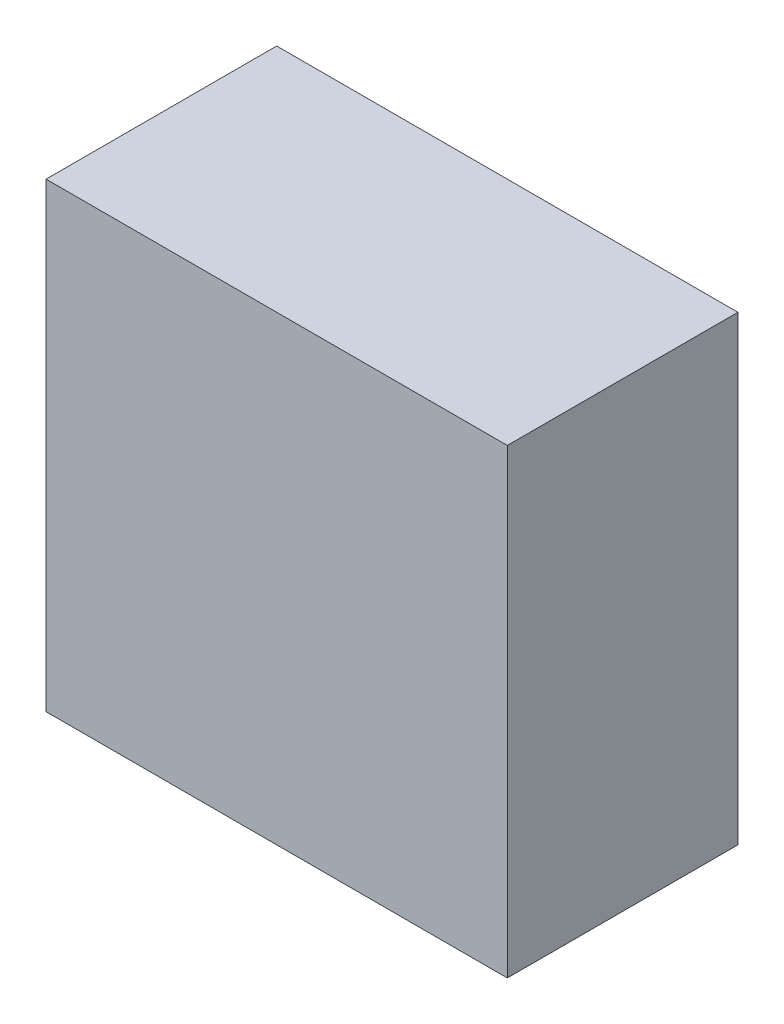
ISO-10303-21;
HEADER;
FILE_DESCRIPTION(('STEP AP214'),'2;1');
FILE_NAME('part.step','',(''),(''),'','','');
FILE_SCHEMA(('AUTOMOTIVE_DESIGN { 1 0 10303 214 1 1 1 1 }'));
ENDSEC;
DATA;
#1=APPLICATION_CONTEXT('core data for automotive mechanical design processes');
#2=APPLICATION_PROTOCOL_DEFINITION('international standard','automotive_design',2000,#1);
#3=PRODUCT_CONTEXT('',#1,'mechanical');
#4=PRODUCT('Part','Part','',(#3));
#5=PRODUCT_RELATED_PRODUCT_CATEGORY('part','',(#4));
#6=PRODUCT_DEFINITION_FORMATION('','',#4);
#7=PRODUCT_DEFINITION_CONTEXT('part definition',#1,'design');
#8=PRODUCT_DEFINITION('design','',#6,#7);
#9=PRODUCT_DEFINITION_SHAPE('','',#8);
#10=(LENGTH_UNIT() NAMED_UNIT(*) SI_UNIT(.MILLI.,.METRE.));
#11=(NAMED_UNIT(*) PLANE_ANGLE_UNIT() SI_UNIT($,.RADIAN.));
#12=(NAMED_UNIT(*) SI_UNIT($,.STERADIAN.) SOLID_ANGLE_UNIT());
#13=UNCERTAINTY_MEASURE_WITH_UNIT(LENGTH_MEASURE(1.E-05),#10,'distance_accuracy_value','');
#14=(GEOMETRIC_REPRESENTATION_CONTEXT(3) GLOBAL_UNCERTAINTY_ASSIGNED_CONTEXT((#13)) GLOBAL_UNIT_ASSIGNED_CONTEXT((#10,
#11,#12)) REPRESENTATION_CONTEXT('',''));
#15=CARTESIAN_POINT('',(0.,0.,0.));
#16=DIRECTION('',(0.,0.,1.));
#17=DIRECTION('',(1.,0.,0.));
#18=AXIS2_PLACEMENT_3D('',#15,#16,#17);
#19=CARTESIAN_POINT('',(0.,0.,2.75));
#20=DIRECTION('',(0.,0.,-1.));
#21=DIRECTION('',(-1.,0.,0.));
#22=AXIS2_PLACEMENT_3D('',#19,#20,#21);
#23=PLANE('',#22);
#24=DIRECTION('',(1.,0.,0.));
#25=VECTOR('',#24,1.);
#26=CARTESIAN_POINT('',(158.313158045854,132.929115844304,2.75));
#27=LINE('',#26,#25);
#28=CARTESIAN_POINT('',(158.313158045854,132.929115844304,2.75));
#29=VERTEX_POINT('',#28);
#30=CARTESIAN_POINT('',(154.313158045854,132.929115844304,2.75));
#31=VERTEX_POINT('',#30);
#32=EDGE_CURVE('E80',#29,#31,#27,.F.);
#33=ORIENTED_EDGE('',*,*,#32,.T.);
#34=DIRECTION('',(0.,1.,0.));
#35=VECTOR('',#34,1.);
#36=CARTESIAN_POINT('',(154.313158045854,132.929115844304,2.75));
#37=LINE('',#36,#35);
#38=CARTESIAN_POINT('',(154.313158045854,128.929115844304,2.75));
#39=VERTEX_POINT('',#38);
#40=EDGE_CURVE('E55',#31,#39,#37,.F.);
#41=ORIENTED_EDGE('',*,*,#40,.T.);
#42=DIRECTION('',(1.,0.,0.));
#43=VECTOR('',#42,1.);
#44=CARTESIAN_POINT('',(158.313158045854,128.929115844304,2.75));
#45=LINE('',#44,#43);
#46=CARTESIAN_POINT('',(158.313158045854,128.929115844304,2.75));
#47=VERTEX_POINT('',#46);
#48=EDGE_CURVE('E57',#39,#47,#45,.T.);
#49=ORIENTED_EDGE('',*,*,#48,.T.);
#50=DIRECTION('',(0.,1.,0.));
#51=VECTOR('',#50,1.);
#52=CARTESIAN_POINT('',(158.313158045854,132.929115844304,2.75));
#53=LINE('',#52,#51);
#54=EDGE_CURVE('E20',#47,#29,#53,.T.);
#55=ORIENTED_EDGE('',*,*,#54,.T.);
#56=EDGE_LOOP('',(#33,#41,#49,#55));
#57=FACE_BOUND('',#56,.T.);
#58=ADVANCED_FACE('F17',(#57),#23,.F.);
#59=CARTESIAN_POINT('',(158.313158045854,132.929115844304,2.75));
#60=DIRECTION('',(-1.,0.,0.));
#61=DIRECTION('',(0.,0.,1.));
#62=AXIS2_PLACEMENT_3D('',#59,#60,#61);
#63=PLANE('',#62);
#64=DIRECTION('',(0.,0.,-1.));
#65=VECTOR('',#64,1.);
#66=CARTESIAN_POINT('',(158.313158045854,132.929115844304,2.75));
#67=LINE('',#66,#65);
#68=CARTESIAN_POINT('',(158.313158045854,132.929115844304,0.75));
#69=VERTEX_POINT('',#68);
#70=EDGE_CURVE('E68',#69,#29,#67,.F.);
#71=ORIENTED_EDGE('',*,*,#70,.T.);
#72=ORIENTED_EDGE('',*,*,#54,.F.);
#73=DIRECTION('',(0.,0.,1.));
#74=VECTOR('',#73,1.);
#75=CARTESIAN_POINT('',(158.313158045854,128.929115844304,2.75));
#76=LINE('',#75,#74);
#77=CARTESIAN_POINT('',(158.313158045854,128.929115844304,0.75));
#78=VERTEX_POINT('',#77);
#79=EDGE_CURVE('E63',#47,#78,#76,.F.);
#80=ORIENTED_EDGE('',*,*,#79,.T.);
#81=DIRECTION('',(0.,1.,0.));
#82=VECTOR('',#81,1.);
#83=CARTESIAN_POINT('',(158.313158045854,0.,0.75));
#84=LINE('',#83,#82);
#85=EDGE_CURVE('E83',#69,#78,#84,.F.);
#86=ORIENTED_EDGE('',*,*,#85,.F.);
#87=EDGE_LOOP('',(#71,#72,#80,#86));
#88=FACE_BOUND('',#87,.T.);
#89=ADVANCED_FACE('F65',(#88),#63,.F.);
#90=CARTESIAN_POINT('',(158.313158045854,128.929115844304,2.75));
#91=DIRECTION('',(0.,1.,0.));
#92=DIRECTION('',(0.,0.,1.));
#93=AXIS2_PLACEMENT_3D('',#90,#91,#92);
#94=PLANE('',#93);
#95=ORIENTED_EDGE('',*,*,#79,.F.);
#96=ORIENTED_EDGE('',*,*,#48,.F.);
#97=DIRECTION('',(0.,0.,-1.));
#98=VECTOR('',#97,1.);
#99=CARTESIAN_POINT('',(154.313158045854,128.929115844304,2.75));
#100=LINE('',#99,#98);
#101=CARTESIAN_POINT('',(154.313158045854,128.929115844304,0.75));
#102=VERTEX_POINT('',#101);
#103=EDGE_CURVE('E75',#39,#102,#100,.T.);
#104=ORIENTED_EDGE('',*,*,#103,.T.);
#105=DIRECTION('',(-1.,0.,0.));
#106=VECTOR('',#105,1.);
#107=CARTESIAN_POINT('',(0.,128.929115844304,0.75));
#108=LINE('',#107,#106);
#109=EDGE_CURVE('E72',#78,#102,#108,.T.);
#110=ORIENTED_EDGE('',*,*,#109,.F.);
#111=EDGE_LOOP('',(#95,#96,#104,#110));
#112=FACE_BOUND('',#111,.T.);
#113=ADVANCED_FACE('F70',(#112),#94,.F.);
#114=CARTESIAN_POINT('',(154.313158045854,132.929115844304,2.75));
#115=DIRECTION('',(1.,0.,0.));
#116=DIRECTION('',(0.,0.,-1.));
#117=AXIS2_PLACEMENT_3D('',#114,#115,#116);
#118=PLANE('',#117);
#119=ORIENTED_EDGE('',*,*,#103,.F.);
#120=ORIENTED_EDGE('',*,*,#40,.F.);
#121=DIRECTION('',(0.,0.,-1.));
#122=VECTOR('',#121,1.);
#123=CARTESIAN_POINT('',(154.313158045854,132.929115844304,2.75));
#124=LINE('',#123,#122);
#125=CARTESIAN_POINT('',(154.313158045854,132.929115844304,0.75));
#126=VERTEX_POINT('',#125);
#127=EDGE_CURVE('E35',#31,#126,#124,.T.);
#128=ORIENTED_EDGE('',*,*,#127,.T.);
#129=DIRECTION('',(0.,1.,0.));
#130=VECTOR('',#129,1.);
#131=CARTESIAN_POINT('',(154.313158045854,0.,0.75));
#132=LINE('',#131,#130);
#133=EDGE_CURVE('E26',#102,#126,#132,.T.);
#134=ORIENTED_EDGE('',*,*,#133,.F.);
#135=EDGE_LOOP('',(#119,#120,#128,#134));
#136=FACE_BOUND('',#135,.T.);
#137=ADVANCED_FACE('F89',(#136),#118,.F.);
#138=CARTESIAN_POINT('',(158.313158045854,132.929115844304,2.75));
#139=DIRECTION('',(0.,-1.,0.));
#140=DIRECTION('',(0.,0.,-1.));
#141=AXIS2_PLACEMENT_3D('',#138,#139,#140);
#142=PLANE('',#141);
#143=ORIENTED_EDGE('',*,*,#127,.F.);
#144=ORIENTED_EDGE('',*,*,#32,.F.);
#145=ORIENTED_EDGE('',*,*,#70,.F.);
#146=DIRECTION('',(-1.,0.,0.));
#147=VECTOR('',#146,1.);
#148=CARTESIAN_POINT('',(0.,132.929115844304,0.75));
#149=LINE('',#148,#147);
#150=EDGE_CURVE('E11',#126,#69,#149,.F.);
#151=ORIENTED_EDGE('',*,*,#150,.F.);
#152=EDGE_LOOP('',(#143,#144,#145,#151));
#153=FACE_BOUND('',#152,.T.);
#154=ADVANCED_FACE('F91',(#153),#142,.F.);
#155=CARTESIAN_POINT('',(0.,0.,0.75));
#156=DIRECTION('',(0.,0.,-1.));
#157=DIRECTION('',(-1.,0.,0.));
#158=AXIS2_PLACEMENT_3D('',#155,#156,#157);
#159=PLANE('',#158);
#160=ORIENTED_EDGE('',*,*,#133,.T.);
#161=ORIENTED_EDGE('',*,*,#150,.T.);
#162=ORIENTED_EDGE('',*,*,#85,.T.);
#163=ORIENTED_EDGE('',*,*,#109,.T.);
#164=EDGE_LOOP('',(#160,#161,#162,#163));
#165=FACE_BOUND('',#164,.T.);
#166=ADVANCED_FACE('F88',(#165),#159,.T.);
#167=CLOSED_SHELL('',(#58,#89,#113,#137,#154,#166));
#168=MANIFOLD_SOLID_BREP('B1',#167);
#169=ADVANCED_BREP_SHAPE_REPRESENTATION('',(#18,#168),#14);
#170=SHAPE_DEFINITION_REPRESENTATION(#9,#169);
ENDSEC;
END-ISO-10303-21;
